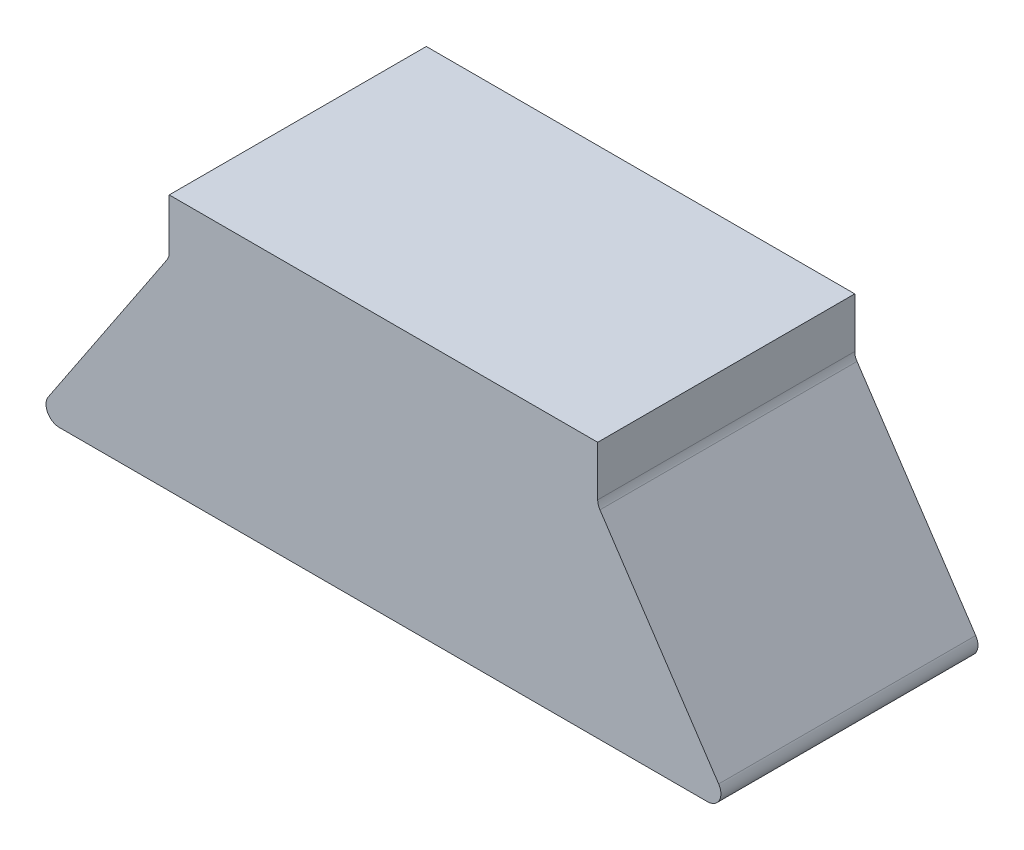
ISO-10303-21;
HEADER;
FILE_DESCRIPTION(('STEP AP214'),'2;1');
FILE_NAME('part.step','',(''),(''),'','','');
FILE_SCHEMA(('AUTOMOTIVE_DESIGN { 1 0 10303 214 1 1 1 1 }'));
ENDSEC;
DATA;
#1=APPLICATION_CONTEXT('core data for automotive mechanical design processes');
#2=APPLICATION_PROTOCOL_DEFINITION('international standard','automotive_design',2000,#1);
#3=PRODUCT_CONTEXT('',#1,'mechanical');
#4=PRODUCT('Part','Part','',(#3));
#5=PRODUCT_RELATED_PRODUCT_CATEGORY('part','',(#4));
#6=PRODUCT_DEFINITION_FORMATION('','',#4);
#7=PRODUCT_DEFINITION_CONTEXT('part definition',#1,'design');
#8=PRODUCT_DEFINITION('design','',#6,#7);
#9=PRODUCT_DEFINITION_SHAPE('','',#8);
#10=(LENGTH_UNIT() NAMED_UNIT(*) SI_UNIT(.MILLI.,.METRE.));
#11=(NAMED_UNIT(*) PLANE_ANGLE_UNIT() SI_UNIT($,.RADIAN.));
#12=(NAMED_UNIT(*) SI_UNIT($,.STERADIAN.) SOLID_ANGLE_UNIT());
#13=UNCERTAINTY_MEASURE_WITH_UNIT(LENGTH_MEASURE(1.E-05),#10,'distance_accuracy_value','');
#14=(GEOMETRIC_REPRESENTATION_CONTEXT(3) GLOBAL_UNCERTAINTY_ASSIGNED_CONTEXT((#13)) GLOBAL_UNIT_ASSIGNED_CONTEXT((#10,
#11,#12)) REPRESENTATION_CONTEXT('',''));
#15=CARTESIAN_POINT('',(0.,0.,0.));
#16=DIRECTION('',(0.,0.,1.));
#17=DIRECTION('',(1.,0.,0.));
#18=AXIS2_PLACEMENT_3D('',#15,#16,#17);
#19=CARTESIAN_POINT('',(15.875,-9.5,9.525));
#20=DIRECTION('',(-1.,0.,0.));
#21=DIRECTION('',(0.,0.,1.));
#22=AXIS2_PLACEMENT_3D('',#19,#20,#21);
#23=PLANE('',#22);
#24=DIRECTION('',(0.,1.,0.));
#25=VECTOR('',#24,1.);
#26=CARTESIAN_POINT('',(15.875,-9.5,9.525));
#27=LINE('',#26,#25);
#28=CARTESIAN_POINT('',(15.875,5.80277563773199,9.525));
#29=VERTEX_POINT('',#28);
#30=CARTESIAN_POINT('',(15.875,9.5,9.525));
#31=VERTEX_POINT('',#30);
#32=EDGE_CURVE('E114',#29,#31,#27,.T.);
#33=ORIENTED_EDGE('',*,*,#32,.F.);
#34=DIRECTION('',(0.,0.,1.));
#35=VECTOR('',#34,1.);
#36=CARTESIAN_POINT('',(15.875,5.80277563773199,9.525));
#37=LINE('',#36,#35);
#38=CARTESIAN_POINT('',(15.875,5.80277563773199,-9.525));
#39=VERTEX_POINT('',#38);
#40=EDGE_CURVE('E169',#29,#39,#37,.F.);
#41=ORIENTED_EDGE('',*,*,#40,.T.);
#42=DIRECTION('',(0.,1.,0.));
#43=VECTOR('',#42,1.);
#44=CARTESIAN_POINT('',(15.875,-9.5,-9.525));
#45=LINE('',#44,#43);
#46=CARTESIAN_POINT('',(15.875,9.5,-9.525));
#47=VERTEX_POINT('',#46);
#48=EDGE_CURVE('E137',#39,#47,#45,.T.);
#49=ORIENTED_EDGE('',*,*,#48,.T.);
#50=DIRECTION('',(0.,0.,-1.));
#51=VECTOR('',#50,1.);
#52=CARTESIAN_POINT('',(15.875,9.5,9.525));
#53=LINE('',#52,#51);
#54=EDGE_CURVE('E130',#31,#47,#53,.T.);
#55=ORIENTED_EDGE('',*,*,#54,.F.);
#56=EDGE_LOOP('',(#33,#41,#49,#55));
#57=FACE_BOUND('',#56,.T.);
#58=ADVANCED_FACE('F37',(#57),#23,.F.);
#59=CARTESIAN_POINT('',(-15.875,9.5,9.525));
#60=DIRECTION('',(0.,-1.,0.));
#61=DIRECTION('',(0.,0.,-1.));
#62=AXIS2_PLACEMENT_3D('',#59,#60,#61);
#63=PLANE('',#62);
#64=DIRECTION('',(-1.,0.,0.));
#65=VECTOR('',#64,1.);
#66=CARTESIAN_POINT('',(-15.875,9.5,-9.525));
#67=LINE('',#66,#65);
#68=CARTESIAN_POINT('',(-15.875,9.5,-9.525));
#69=VERTEX_POINT('',#68);
#70=EDGE_CURVE('E189',#47,#69,#67,.T.);
#71=ORIENTED_EDGE('',*,*,#70,.T.);
#72=DIRECTION('',(0.,0.,-1.));
#73=VECTOR('',#72,1.);
#74=CARTESIAN_POINT('',(-15.875,9.5,9.525));
#75=LINE('',#74,#73);
#76=CARTESIAN_POINT('',(-15.875,9.5,9.525));
#77=VERTEX_POINT('',#76);
#78=EDGE_CURVE('E132',#77,#69,#75,.T.);
#79=ORIENTED_EDGE('',*,*,#78,.F.);
#80=DIRECTION('',(-1.,0.,0.));
#81=VECTOR('',#80,1.);
#82=CARTESIAN_POINT('',(-15.875,9.5,9.525));
#83=LINE('',#82,#81);
#84=EDGE_CURVE('E119',#31,#77,#83,.T.);
#85=ORIENTED_EDGE('',*,*,#84,.F.);
#86=ORIENTED_EDGE('',*,*,#54,.T.);
#87=EDGE_LOOP('',(#71,#79,#85,#86));
#88=FACE_BOUND('',#87,.T.);
#89=ADVANCED_FACE('F129',(#88),#63,.F.);
#90=CARTESIAN_POINT('',(-15.875,-9.5,9.525));
#91=DIRECTION('',(1.,0.,0.));
#92=DIRECTION('',(0.,0.,-1.));
#93=AXIS2_PLACEMENT_3D('',#90,#91,#92);
#94=PLANE('',#93);
#95=DIRECTION('',(0.,-1.,0.));
#96=VECTOR('',#95,1.);
#97=CARTESIAN_POINT('',(-15.875,-9.5,-9.525));
#98=LINE('',#97,#96);
#99=CARTESIAN_POINT('',(-15.875,5.802775637732,-9.525));
#100=VERTEX_POINT('',#99);
#101=EDGE_CURVE('E188',#69,#100,#98,.T.);
#102=ORIENTED_EDGE('',*,*,#101,.T.);
#103=DIRECTION('',(0.,0.,1.));
#104=VECTOR('',#103,1.);
#105=CARTESIAN_POINT('',(-15.875,5.802775637732,9.525));
#106=LINE('',#105,#104);
#107=CARTESIAN_POINT('',(-15.875,5.802775637732,9.525));
#108=VERTEX_POINT('',#107);
#109=EDGE_CURVE('E166',#100,#108,#106,.T.);
#110=ORIENTED_EDGE('',*,*,#109,.T.);
#111=DIRECTION('',(0.,-1.,0.));
#112=VECTOR('',#111,1.);
#113=CARTESIAN_POINT('',(-15.875,-9.5,9.525));
#114=LINE('',#113,#112);
#115=EDGE_CURVE('E134',#77,#108,#114,.T.);
#116=ORIENTED_EDGE('',*,*,#115,.F.);
#117=ORIENTED_EDGE('',*,*,#78,.T.);
#118=EDGE_LOOP('',(#102,#110,#116,#117));
#119=FACE_BOUND('',#118,.T.);
#120=ADVANCED_FACE('F187',(#119),#94,.F.);
#121=CARTESIAN_POINT('',(-15.875,-9.5,9.525));
#122=DIRECTION('',(0.,1.,0.));
#123=DIRECTION('',(0.,0.,1.));
#124=AXIS2_PLACEMENT_3D('',#121,#122,#123);
#125=PLANE('',#124);
#126=DIRECTION('',(1.,0.,0.));
#127=VECTOR('',#126,1.);
#128=CARTESIAN_POINT('',(-15.875,-9.5,-9.525));
#129=LINE('',#128,#127);
#130=CARTESIAN_POINT('',(-24.0064829081787,-9.5,-9.525));
#131=VERTEX_POINT('',#130);
#132=CARTESIAN_POINT('',(24.0064829081787,-9.5,-9.525));
#133=VERTEX_POINT('',#132);
#134=EDGE_CURVE('E125',#131,#133,#129,.T.);
#135=ORIENTED_EDGE('',*,*,#134,.T.);
#136=DIRECTION('',(0.,0.,1.));
#137=VECTOR('',#136,1.);
#138=CARTESIAN_POINT('',(24.0064829081787,-9.5,9.525));
#139=LINE('',#138,#137);
#140=CARTESIAN_POINT('',(24.0064829081787,-9.5,9.525));
#141=VERTEX_POINT('',#140);
#142=EDGE_CURVE('E141',#133,#141,#139,.T.);
#143=ORIENTED_EDGE('',*,*,#142,.T.);
#144=DIRECTION('',(1.,0.,0.));
#145=VECTOR('',#144,1.);
#146=CARTESIAN_POINT('',(-15.875,-9.5,9.525));
#147=LINE('',#146,#145);
#148=CARTESIAN_POINT('',(-24.0064829081787,-9.5,9.525));
#149=VERTEX_POINT('',#148);
#150=EDGE_CURVE('E143',#149,#141,#147,.T.);
#151=ORIENTED_EDGE('',*,*,#150,.F.);
#152=DIRECTION('',(0.,0.,1.));
#153=VECTOR('',#152,1.);
#154=CARTESIAN_POINT('',(-24.0064829081787,-9.5,-9.52500000000001));
#155=LINE('',#154,#153);
#156=EDGE_CURVE('E139',#149,#131,#155,.F.);
#157=ORIENTED_EDGE('',*,*,#156,.T.);
#158=EDGE_LOOP('',(#135,#143,#151,#157));
#159=FACE_BOUND('',#158,.T.);
#160=ADVANCED_FACE('F213',(#159),#125,.F.);
#161=CARTESIAN_POINT('',(0.,0.,9.525));
#162=DIRECTION('',(0.,0.,-1.));
#163=DIRECTION('',(-1.,0.,0.));
#164=AXIS2_PLACEMENT_3D('',#161,#162,#163);
#165=PLANE('',#164);
#166=ORIENTED_EDGE('',*,*,#150,.T.);
#167=CARTESIAN_POINT('',(24.0064829081787,-8.5,9.525));
#168=DIRECTION('',(0.,0.,-1.));
#169=DIRECTION('',(-1.,0.,0.));
#170=AXIS2_PLACEMENT_3D('',#167,#168,#169);
#171=CIRCLE('',#170,1.);
#172=CARTESIAN_POINT('',(24.8385332025165,-7.94529980377477,9.525));
#173=VERTEX_POINT('',#172);
#174=EDGE_CURVE('E151',#141,#173,#171,.F.);
#175=ORIENTED_EDGE('',*,*,#174,.T.);
#176=DIRECTION('',(-0.554700196225229,0.832050294337843,0.));
#177=VECTOR('',#176,1.);
#178=CARTESIAN_POINT('',(15.875,5.5,9.525));
#179=LINE('',#178,#177);
#180=CARTESIAN_POINT('',(16.0429497056622,5.24807544150676,9.525));
#181=VERTEX_POINT('',#180);
#182=EDGE_CURVE('E200',#173,#181,#179,.T.);
#183=ORIENTED_EDGE('',*,*,#182,.T.);
#184=CARTESIAN_POINT('',(16.875,5.80277563773199,9.525));
#185=DIRECTION('',(0.,0.,-1.));
#186=DIRECTION('',(-1.,0.,0.));
#187=AXIS2_PLACEMENT_3D('',#184,#185,#186);
#188=CIRCLE('',#187,1.);
#189=EDGE_CURVE('E45',#181,#29,#188,.T.);
#190=ORIENTED_EDGE('',*,*,#189,.T.);
#191=ORIENTED_EDGE('',*,*,#32,.T.);
#192=ORIENTED_EDGE('',*,*,#84,.T.);
#193=ORIENTED_EDGE('',*,*,#115,.T.);
#194=CARTESIAN_POINT('',(-16.875,5.802775637732,9.525));
#195=DIRECTION('',(0.,0.,-1.));
#196=DIRECTION('',(-1.,0.,0.));
#197=AXIS2_PLACEMENT_3D('',#194,#195,#196);
#198=CIRCLE('',#197,1.);
#199=CARTESIAN_POINT('',(-16.0429497056622,5.24807544150676,9.525));
#200=VERTEX_POINT('',#199);
#201=EDGE_CURVE('E171',#108,#200,#198,.T.);
#202=ORIENTED_EDGE('',*,*,#201,.T.);
#203=DIRECTION('',(-0.554700196225229,-0.832050294337843,0.));
#204=VECTOR('',#203,1.);
#205=CARTESIAN_POINT('',(-25.875,-9.5,9.525));
#206=LINE('',#205,#204);
#207=CARTESIAN_POINT('',(-24.8385332025165,-7.94529980377477,9.525));
#208=VERTEX_POINT('',#207);
#209=EDGE_CURVE('E175',#200,#208,#206,.T.);
#210=ORIENTED_EDGE('',*,*,#209,.T.);
#211=CARTESIAN_POINT('',(-24.0064829081787,-8.5,9.525));
#212=DIRECTION('',(0.,0.,-1.));
#213=DIRECTION('',(-1.,0.,0.));
#214=AXIS2_PLACEMENT_3D('',#211,#212,#213);
#215=CIRCLE('',#214,1.);
#216=EDGE_CURVE('E149',#208,#149,#215,.F.);
#217=ORIENTED_EDGE('',*,*,#216,.T.);
#218=EDGE_LOOP('',(#166,#175,#183,#190,#191,#192,#193,#202,#210,#217));
#219=FACE_BOUND('',#218,.T.);
#220=ADVANCED_FACE('F117',(#219),#165,.F.);
#221=CARTESIAN_POINT('',(0.,0.,-9.525));
#222=DIRECTION('',(0.,0.,-1.));
#223=DIRECTION('',(-1.,0.,0.));
#224=AXIS2_PLACEMENT_3D('',#221,#222,#223);
#225=PLANE('',#224);
#226=DIRECTION('',(-0.554700196225229,0.832050294337843,0.));
#227=VECTOR('',#226,1.);
#228=CARTESIAN_POINT('',(15.875,5.5,-9.525));
#229=LINE('',#228,#227);
#230=CARTESIAN_POINT('',(24.8385332025165,-7.94529980377477,-9.525));
#231=VERTEX_POINT('',#230);
#232=CARTESIAN_POINT('',(16.0429497056622,5.24807544150676,-9.525));
#233=VERTEX_POINT('',#232);
#234=EDGE_CURVE('E183',#231,#233,#229,.T.);
#235=ORIENTED_EDGE('',*,*,#234,.F.);
#236=CARTESIAN_POINT('',(24.0064829081787,-8.5,-9.525));
#237=DIRECTION('',(0.,0.,-1.));
#238=DIRECTION('',(-1.,0.,0.));
#239=AXIS2_PLACEMENT_3D('',#236,#237,#238);
#240=CIRCLE('',#239,1.);
#241=EDGE_CURVE('E159',#231,#133,#240,.T.);
#242=ORIENTED_EDGE('',*,*,#241,.T.);
#243=ORIENTED_EDGE('',*,*,#134,.F.);
#244=CARTESIAN_POINT('',(-24.0064829081787,-8.5,-9.525));
#245=DIRECTION('',(0.,0.,-1.));
#246=DIRECTION('',(-1.,0.,0.));
#247=AXIS2_PLACEMENT_3D('',#244,#245,#246);
#248=CIRCLE('',#247,1.);
#249=CARTESIAN_POINT('',(-24.8385332025165,-7.94529980377477,-9.525));
#250=VERTEX_POINT('',#249);
#251=EDGE_CURVE('E58',#131,#250,#248,.T.);
#252=ORIENTED_EDGE('',*,*,#251,.T.);
#253=DIRECTION('',(-0.554700196225229,-0.832050294337844,0.));
#254=VECTOR('',#253,1.);
#255=CARTESIAN_POINT('',(-25.875,-9.5,-9.525));
#256=LINE('',#255,#254);
#257=CARTESIAN_POINT('',(-16.0429497056622,5.24807544150677,-9.525));
#258=VERTEX_POINT('',#257);
#259=EDGE_CURVE('E182',#258,#250,#256,.T.);
#260=ORIENTED_EDGE('',*,*,#259,.F.);
#261=CARTESIAN_POINT('',(-16.875,5.802775637732,-9.525));
#262=DIRECTION('',(0.,0.,-1.));
#263=DIRECTION('',(-1.,0.,0.));
#264=AXIS2_PLACEMENT_3D('',#261,#262,#263);
#265=CIRCLE('',#264,1.);
#266=EDGE_CURVE('E52',#258,#100,#265,.F.);
#267=ORIENTED_EDGE('',*,*,#266,.T.);
#268=ORIENTED_EDGE('',*,*,#101,.F.);
#269=ORIENTED_EDGE('',*,*,#70,.F.);
#270=ORIENTED_EDGE('',*,*,#48,.F.);
#271=CARTESIAN_POINT('',(16.875,5.80277563773199,-9.525));
#272=DIRECTION('',(0.,0.,-1.));
#273=DIRECTION('',(-1.,0.,0.));
#274=AXIS2_PLACEMENT_3D('',#271,#272,#273);
#275=CIRCLE('',#274,1.);
#276=EDGE_CURVE('E11',#39,#233,#275,.F.);
#277=ORIENTED_EDGE('',*,*,#276,.T.);
#278=EDGE_LOOP('',(#235,#242,#243,#252,#260,#267,#268,#269,#270,#277));
#279=FACE_BOUND('',#278,.T.);
#280=ADVANCED_FACE('F211',(#279),#225,.T.);
#281=CARTESIAN_POINT('',(-25.875,-9.5,-27.55275637732));
#282=DIRECTION('',(-0.832050294337844,0.554700196225229,0.));
#283=DIRECTION('',(-0.554700196225229,-0.832050294337844,0.));
#284=AXIS2_PLACEMENT_3D('',#281,#282,#283);
#285=PLANE('',#284);
#286=ORIENTED_EDGE('',*,*,#259,.T.);
#287=DIRECTION('',(0.,0.,1.));
#288=VECTOR('',#287,1.);
#289=CARTESIAN_POINT('',(-24.8385332025165,-7.94529980377477,9.52499999999998));
#290=LINE('',#289,#288);
#291=EDGE_CURVE('E163',#250,#208,#290,.T.);
#292=ORIENTED_EDGE('',*,*,#291,.T.);
#293=ORIENTED_EDGE('',*,*,#209,.F.);
#294=DIRECTION('',(0.,0.,1.));
#295=VECTOR('',#294,1.);
#296=CARTESIAN_POINT('',(-16.0429497056622,5.24807544150676,-27.55275637732));
#297=LINE('',#296,#295);
#298=EDGE_CURVE('E161',#200,#258,#297,.F.);
#299=ORIENTED_EDGE('',*,*,#298,.T.);
#300=EDGE_LOOP('',(#286,#292,#293,#299));
#301=FACE_BOUND('',#300,.T.);
#302=ADVANCED_FACE('F180',(#301),#285,.T.);
#303=CARTESIAN_POINT('',(15.875,5.5,-27.55275637732));
#304=DIRECTION('',(0.832050294337843,0.554700196225229,0.));
#305=DIRECTION('',(-0.554700196225229,0.832050294337843,0.));
#306=AXIS2_PLACEMENT_3D('',#303,#304,#305);
#307=PLANE('',#306);
#308=ORIENTED_EDGE('',*,*,#182,.F.);
#309=DIRECTION('',(0.,0.,1.));
#310=VECTOR('',#309,1.);
#311=CARTESIAN_POINT('',(24.8385332025165,-7.94529980377477,-9.525));
#312=LINE('',#311,#310);
#313=EDGE_CURVE('E156',#173,#231,#312,.F.);
#314=ORIENTED_EDGE('',*,*,#313,.T.);
#315=ORIENTED_EDGE('',*,*,#234,.T.);
#316=DIRECTION('',(0.,0.,1.));
#317=VECTOR('',#316,1.);
#318=CARTESIAN_POINT('',(16.0429497056622,5.24807544150676,-27.55275637732));
#319=LINE('',#318,#317);
#320=EDGE_CURVE('E153',#233,#181,#319,.T.);
#321=ORIENTED_EDGE('',*,*,#320,.T.);
#322=EDGE_LOOP('',(#308,#314,#315,#321));
#323=FACE_BOUND('',#322,.T.);
#324=ADVANCED_FACE('F204',(#323),#307,.T.);
#325=CARTESIAN_POINT('',(24.0064829081787,-8.5,9.525));
#326=DIRECTION('',(0.,0.,-1.));
#327=DIRECTION('',(-1.,0.,0.));
#328=AXIS2_PLACEMENT_3D('',#325,#326,#327);
#329=CYLINDRICAL_SURFACE('',#328,1.);
#330=ORIENTED_EDGE('',*,*,#241,.F.);
#331=ORIENTED_EDGE('',*,*,#313,.F.);
#332=ORIENTED_EDGE('',*,*,#174,.F.);
#333=ORIENTED_EDGE('',*,*,#142,.F.);
#334=EDGE_LOOP('',(#330,#331,#332,#333));
#335=FACE_BOUND('',#334,.T.);
#336=ADVANCED_FACE('F209',(#335),#329,.T.);
#337=CARTESIAN_POINT('',(-24.0064829081787,-8.5,-27.55275637732));
#338=DIRECTION('',(0.,0.,-1.));
#339=DIRECTION('',(-1.,0.,0.));
#340=AXIS2_PLACEMENT_3D('',#337,#338,#339);
#341=CYLINDRICAL_SURFACE('',#340,1.);
#342=ORIENTED_EDGE('',*,*,#251,.F.);
#343=ORIENTED_EDGE('',*,*,#156,.F.);
#344=ORIENTED_EDGE('',*,*,#216,.F.);
#345=ORIENTED_EDGE('',*,*,#291,.F.);
#346=EDGE_LOOP('',(#342,#343,#344,#345));
#347=FACE_BOUND('',#346,.T.);
#348=ADVANCED_FACE('F217',(#347),#341,.T.);
#349=CARTESIAN_POINT('',(-16.875,5.802775637732,9.525));
#350=DIRECTION('',(0.,0.,1.));
#351=DIRECTION('',(1.,0.,0.));
#352=AXIS2_PLACEMENT_3D('',#349,#350,#351);
#353=CYLINDRICAL_SURFACE('',#352,1.);
#354=ORIENTED_EDGE('',*,*,#266,.F.);
#355=ORIENTED_EDGE('',*,*,#298,.F.);
#356=ORIENTED_EDGE('',*,*,#201,.F.);
#357=ORIENTED_EDGE('',*,*,#109,.F.);
#358=EDGE_LOOP('',(#354,#355,#356,#357));
#359=FACE_BOUND('',#358,.T.);
#360=ADVANCED_FACE('F185',(#359),#353,.F.);
#361=CARTESIAN_POINT('',(16.875,5.80277563773199,-27.55275637732));
#362=DIRECTION('',(0.,0.,1.));
#363=DIRECTION('',(1.,0.,0.));
#364=AXIS2_PLACEMENT_3D('',#361,#362,#363);
#365=CYLINDRICAL_SURFACE('',#364,1.);
#366=ORIENTED_EDGE('',*,*,#276,.F.);
#367=ORIENTED_EDGE('',*,*,#40,.F.);
#368=ORIENTED_EDGE('',*,*,#189,.F.);
#369=ORIENTED_EDGE('',*,*,#320,.F.);
#370=EDGE_LOOP('',(#366,#367,#368,#369));
#371=FACE_BOUND('',#370,.T.);
#372=ADVANCED_FACE('F39',(#371),#365,.F.);
#373=CLOSED_SHELL('',(#58,#89,#120,#160,#220,#280,#302,#324,#336,#348,#360,#372));
#374=MANIFOLD_SOLID_BREP('B2',#373);
#375=ADVANCED_BREP_SHAPE_REPRESENTATION('',(#18,#374),#14);
#376=SHAPE_DEFINITION_REPRESENTATION(#9,#375);
ENDSEC;
END-ISO-10303-21;
